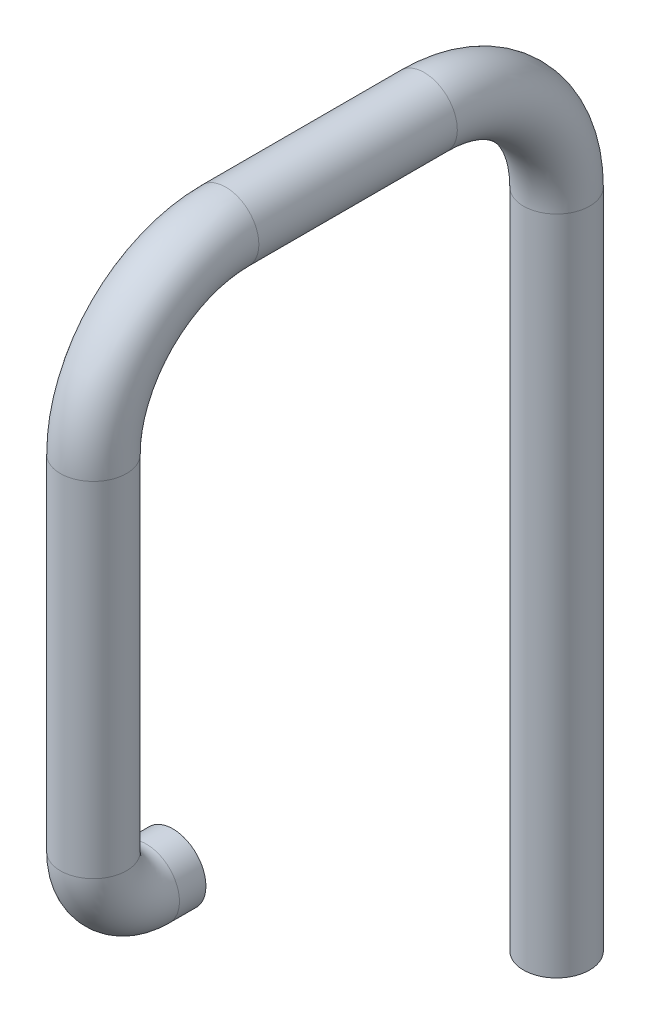
ISO-10303-21;
HEADER;
FILE_DESCRIPTION(('STEP AP214'),'2;1');
FILE_NAME('part.step','',(''),(''),'','','');
FILE_SCHEMA(('AUTOMOTIVE_DESIGN { 1 0 10303 214 1 1 1 1 }'));
ENDSEC;
DATA;
#1=APPLICATION_CONTEXT('core data for automotive mechanical design processes');
#2=APPLICATION_PROTOCOL_DEFINITION('international standard','automotive_design',2000,#1);
#3=PRODUCT_CONTEXT('',#1,'mechanical');
#4=PRODUCT('Part','Part','',(#3));
#5=PRODUCT_RELATED_PRODUCT_CATEGORY('part','',(#4));
#6=PRODUCT_DEFINITION_FORMATION('','',#4);
#7=PRODUCT_DEFINITION_CONTEXT('part definition',#1,'design');
#8=PRODUCT_DEFINITION('design','',#6,#7);
#9=PRODUCT_DEFINITION_SHAPE('','',#8);
#10=(LENGTH_UNIT() NAMED_UNIT(*) SI_UNIT(.MILLI.,.METRE.));
#11=(NAMED_UNIT(*) PLANE_ANGLE_UNIT() SI_UNIT($,.RADIAN.));
#12=(NAMED_UNIT(*) SI_UNIT($,.STERADIAN.) SOLID_ANGLE_UNIT());
#13=UNCERTAINTY_MEASURE_WITH_UNIT(LENGTH_MEASURE(1.E-05),#10,'distance_accuracy_value','');
#14=(GEOMETRIC_REPRESENTATION_CONTEXT(3) GLOBAL_UNCERTAINTY_ASSIGNED_CONTEXT((#13)) GLOBAL_UNIT_ASSIGNED_CONTEXT((#10,
#11,#12)) REPRESENTATION_CONTEXT('',''));
#15=CARTESIAN_POINT('',(0.,0.,0.));
#16=DIRECTION('',(0.,0.,1.));
#17=DIRECTION('',(1.,0.,0.));
#18=AXIS2_PLACEMENT_3D('',#15,#16,#17);
#19=CARTESIAN_POINT('',(0.,0.,0.));
#20=DIRECTION('',(0.,0.,1.));
#21=DIRECTION('',(1.,0.,0.));
#22=AXIS2_PLACEMENT_3D('',#19,#20,#21);
#23=PLANE('',#22);
#24=CARTESIAN_POINT('',(0.,0.,0.));
#25=DIRECTION('',(0.,0.,1.));
#26=DIRECTION('',(1.,0.,0.));
#27=AXIS2_PLACEMENT_3D('',#24,#25,#26);
#28=CIRCLE('',#27,2.5);
#29=CARTESIAN_POINT('',(2.5,0.,0.));
#30=VERTEX_POINT('',#29);
#31=EDGE_CURVE('E63',#30,#30,#28,.T.);
#32=ORIENTED_EDGE('',*,*,#31,.F.);
#33=EDGE_LOOP('',(#32));
#34=FACE_BOUND('',#33,.T.);
#35=ADVANCED_FACE('F35',(#34),#23,.F.);
#36=CARTESIAN_POINT('',(0.,-20.,-29.));
#37=DIRECTION('',(0.,-1.,0.));
#38=DIRECTION('',(1.,0.,0.));
#39=AXIS2_PLACEMENT_3D('',#36,#37,#38);
#40=PLANE('',#39);
#41=CARTESIAN_POINT('',(0.,-20.,-29.));
#42=DIRECTION('',(0.,-1.,0.));
#43=DIRECTION('',(1.,0.,0.));
#44=AXIS2_PLACEMENT_3D('',#41,#42,#43);
#45=CIRCLE('',#44,2.5);
#46=CARTESIAN_POINT('',(2.5,-20.,-29.));
#47=VERTEX_POINT('',#46);
#48=EDGE_CURVE('E10',#47,#47,#45,.T.);
#49=ORIENTED_EDGE('',*,*,#48,.T.);
#50=EDGE_LOOP('',(#49));
#51=FACE_BOUND('',#50,.T.);
#52=ADVANCED_FACE('F70',(#51),#40,.T.);
#53=CARTESIAN_POINT('',(0.,0.,0.));
#54=DIRECTION('',(0.,0.,1.));
#55=DIRECTION('',(1.,0.,0.));
#56=AXIS2_PLACEMENT_3D('',#53,#54,#55);
#57=CYLINDRICAL_SURFACE('',#56,2.5);
#58=CARTESIAN_POINT('',(0.,0.,1.99999999999997));
#59=DIRECTION('',(0.,0.,1.));
#60=DIRECTION('',(1.,0.,0.));
#61=AXIS2_PLACEMENT_3D('',#58,#59,#60);
#62=CIRCLE('',#61,2.5);
#63=CARTESIAN_POINT('',(0.,-2.5,1.99999999999995));
#64=VERTEX_POINT('',#63);
#65=EDGE_CURVE('E60',#64,#64,#62,.T.);
#66=ORIENTED_EDGE('',*,*,#65,.F.);
#67=EDGE_LOOP('',(#66));
#68=FACE_BOUND('',#67,.T.);
#69=ORIENTED_EDGE('',*,*,#31,.T.);
#70=EDGE_LOOP('',(#69));
#71=FACE_BOUND('',#70,.T.);
#72=ADVANCED_FACE('F67',(#68,#71),#57,.T.);
#73=CARTESIAN_POINT('',(0.,4.,2.));
#74=DIRECTION('',(-1.,0.,0.));
#75=DIRECTION('',(0.,0.,1.));
#76=AXIS2_PLACEMENT_3D('',#73,#74,#75);
#77=TOROIDAL_SURFACE('',#76,4.,2.5);
#78=CARTESIAN_POINT('',(0.,4.,6.));
#79=DIRECTION('',(0.,1.,0.));
#80=DIRECTION('',(1.,0.,0.));
#81=AXIS2_PLACEMENT_3D('',#78,#79,#80);
#82=CIRCLE('',#81,2.5);
#83=CARTESIAN_POINT('',(0.,4.,8.5));
#84=VERTEX_POINT('',#83);
#85=EDGE_CURVE('E57',#84,#84,#82,.T.);
#86=CARTESIAN_POINT('',(0.,4.,2.));
#87=DIRECTION('',(-1.,0.,0.));
#88=DIRECTION('',(0.,0.,1.));
#89=AXIS2_PLACEMENT_3D('',#86,#87,#88);
#90=CIRCLE('',#89,6.5);
#91=EDGE_CURVE('',#64,#84,#90,.T.);
#92=ORIENTED_EDGE('',*,*,#65,.T.);
#93=ORIENTED_EDGE('',*,*,#85,.F.);
#94=ORIENTED_EDGE('',*,*,#91,.T.);
#95=ORIENTED_EDGE('',*,*,#91,.F.);
#96=EDGE_LOOP('',(#92,#94,#93,#95));
#97=FACE_BOUND('',#96,.T.);
#98=ADVANCED_FACE('F96',(#97),#77,.T.);
#99=CARTESIAN_POINT('',(0.,4.,6.));
#100=DIRECTION('',(0.,1.,0.));
#101=DIRECTION('',(0.,0.,1.));
#102=AXIS2_PLACEMENT_3D('',#99,#100,#101);
#103=CYLINDRICAL_SURFACE('',#102,2.5);
#104=CARTESIAN_POINT('',(0.,29.9999999999999,6.));
#105=DIRECTION('',(0.,1.,0.));
#106=DIRECTION('',(1.,0.,0.));
#107=AXIS2_PLACEMENT_3D('',#104,#105,#106);
#108=CIRCLE('',#107,2.5);
#109=CARTESIAN_POINT('',(0.,29.9999999999999,8.5));
#110=VERTEX_POINT('',#109);
#111=EDGE_CURVE('E54',#110,#110,#108,.T.);
#112=ORIENTED_EDGE('',*,*,#111,.F.);
#113=EDGE_LOOP('',(#112));
#114=FACE_BOUND('',#113,.T.);
#115=ORIENTED_EDGE('',*,*,#85,.T.);
#116=EDGE_LOOP('',(#115));
#117=FACE_BOUND('',#116,.T.);
#118=ADVANCED_FACE('F92',(#114,#117),#103,.T.);
#119=CARTESIAN_POINT('',(0.,30.,-4.));
#120=DIRECTION('',(-1.,0.,0.));
#121=DIRECTION('',(0.,0.,1.));
#122=AXIS2_PLACEMENT_3D('',#119,#120,#121);
#123=TOROIDAL_SURFACE('',#122,10.,2.5);
#124=CARTESIAN_POINT('',(0.,40.,-4.00000000000007));
#125=DIRECTION('',(0.,0.,-1.));
#126=DIRECTION('',(1.,0.,0.));
#127=AXIS2_PLACEMENT_3D('',#124,#125,#126);
#128=CIRCLE('',#127,2.5);
#129=CARTESIAN_POINT('',(0.,42.5,-4.00000000000009));
#130=VERTEX_POINT('',#129);
#131=EDGE_CURVE('E49',#130,#130,#128,.T.);
#132=CARTESIAN_POINT('',(0.,30.,-4.));
#133=DIRECTION('',(-1.,0.,0.));
#134=DIRECTION('',(0.,0.,1.));
#135=AXIS2_PLACEMENT_3D('',#132,#133,#134);
#136=CIRCLE('',#135,12.5);
#137=EDGE_CURVE('',#110,#130,#136,.T.);
#138=ORIENTED_EDGE('',*,*,#111,.T.);
#139=ORIENTED_EDGE('',*,*,#131,.F.);
#140=ORIENTED_EDGE('',*,*,#137,.T.);
#141=ORIENTED_EDGE('',*,*,#137,.F.);
#142=EDGE_LOOP('',(#138,#140,#139,#141));
#143=FACE_BOUND('',#142,.T.);
#144=ADVANCED_FACE('F88',(#143),#123,.T.);
#145=CARTESIAN_POINT('',(0.,40.,-4.00000000000007));
#146=DIRECTION('',(0.,0.,-1.));
#147=DIRECTION('',(-1.,0.,0.));
#148=AXIS2_PLACEMENT_3D('',#145,#146,#147);
#149=CYLINDRICAL_SURFACE('',#148,2.5);
#150=CARTESIAN_POINT('',(0.,40.,-18.9999999999999));
#151=DIRECTION('',(0.,0.,-1.));
#152=DIRECTION('',(1.,0.,0.));
#153=AXIS2_PLACEMENT_3D('',#150,#151,#152);
#154=CIRCLE('',#153,2.5);
#155=CARTESIAN_POINT('',(0.,42.5,-18.9999999999999));
#156=VERTEX_POINT('',#155);
#157=EDGE_CURVE('E45',#156,#156,#154,.T.);
#158=ORIENTED_EDGE('',*,*,#157,.F.);
#159=EDGE_LOOP('',(#158));
#160=FACE_BOUND('',#159,.T.);
#161=ORIENTED_EDGE('',*,*,#131,.T.);
#162=EDGE_LOOP('',(#161));
#163=FACE_BOUND('',#162,.T.);
#164=ADVANCED_FACE('F82',(#160,#163),#149,.T.);
#165=CARTESIAN_POINT('',(0.,30.,-19.));
#166=DIRECTION('',(-1.,0.,0.));
#167=DIRECTION('',(0.,0.,1.));
#168=AXIS2_PLACEMENT_3D('',#165,#166,#167);
#169=TOROIDAL_SURFACE('',#168,10.,2.5);
#170=CARTESIAN_POINT('',(0.,29.9999999999999,-29.));
#171=DIRECTION('',(0.,-1.,0.));
#172=DIRECTION('',(1.,0.,0.));
#173=AXIS2_PLACEMENT_3D('',#170,#171,#172);
#174=CIRCLE('',#173,2.5);
#175=CARTESIAN_POINT('',(0.,29.9999999999999,-31.5));
#176=VERTEX_POINT('',#175);
#177=EDGE_CURVE('E41',#176,#176,#174,.T.);
#178=CARTESIAN_POINT('',(0.,30.,-19.));
#179=DIRECTION('',(-1.,0.,0.));
#180=DIRECTION('',(0.,0.,1.));
#181=AXIS2_PLACEMENT_3D('',#178,#179,#180);
#182=CIRCLE('',#181,12.5);
#183=EDGE_CURVE('',#156,#176,#182,.T.);
#184=ORIENTED_EDGE('',*,*,#157,.T.);
#185=ORIENTED_EDGE('',*,*,#177,.F.);
#186=ORIENTED_EDGE('',*,*,#183,.T.);
#187=ORIENTED_EDGE('',*,*,#183,.F.);
#188=EDGE_LOOP('',(#184,#186,#185,#187));
#189=FACE_BOUND('',#188,.T.);
#190=ADVANCED_FACE('F76',(#189),#169,.T.);
#191=CARTESIAN_POINT('',(0.,29.9999999999999,-29.));
#192=DIRECTION('',(0.,-1.,0.));
#193=DIRECTION('',(0.,0.,-1.));
#194=AXIS2_PLACEMENT_3D('',#191,#192,#193);
#195=CYLINDRICAL_SURFACE('',#194,2.5);
#196=ORIENTED_EDGE('',*,*,#48,.F.);
#197=EDGE_LOOP('',(#196));
#198=FACE_BOUND('',#197,.T.);
#199=ORIENTED_EDGE('',*,*,#177,.T.);
#200=EDGE_LOOP('',(#199));
#201=FACE_BOUND('',#200,.T.);
#202=ADVANCED_FACE('F74',(#198,#201),#195,.T.);
#203=CLOSED_SHELL('',(#35,#52,#72,#98,#118,#144,#164,#190,#202));
#204=MANIFOLD_SOLID_BREP('B2',#203);
#205=ADVANCED_BREP_SHAPE_REPRESENTATION('',(#18,#204),#14);
#206=SHAPE_DEFINITION_REPRESENTATION(#9,#205);
ENDSEC;
END-ISO-10303-21;
